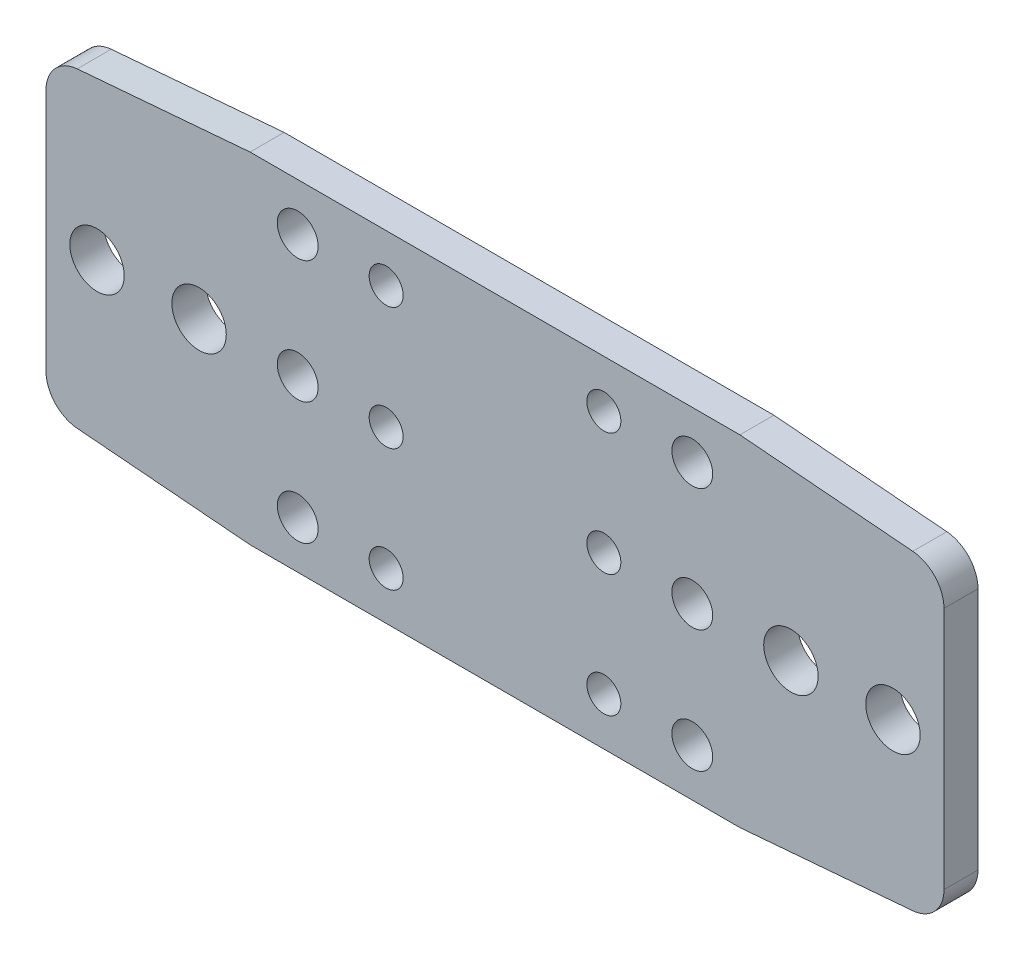
ISO-10303-21;
HEADER;
FILE_DESCRIPTION(('STEP AP214'),'2;1');
FILE_NAME('part.step','',(''),(''),'','','');
FILE_SCHEMA(('AUTOMOTIVE_DESIGN { 1 0 10303 214 1 1 1 1 }'));
ENDSEC;
DATA;
#1=APPLICATION_CONTEXT('core data for automotive mechanical design processes');
#2=APPLICATION_PROTOCOL_DEFINITION('international standard','automotive_design',2000,#1);
#3=PRODUCT_CONTEXT('',#1,'mechanical');
#4=PRODUCT('Part','Part','',(#3));
#5=PRODUCT_RELATED_PRODUCT_CATEGORY('part','',(#4));
#6=PRODUCT_DEFINITION_FORMATION('','',#4);
#7=PRODUCT_DEFINITION_CONTEXT('part definition',#1,'design');
#8=PRODUCT_DEFINITION('design','',#6,#7);
#9=PRODUCT_DEFINITION_SHAPE('','',#8);
#10=(LENGTH_UNIT() NAMED_UNIT(*) SI_UNIT(.MILLI.,.METRE.));
#11=(NAMED_UNIT(*) PLANE_ANGLE_UNIT() SI_UNIT($,.RADIAN.));
#12=(NAMED_UNIT(*) SI_UNIT($,.STERADIAN.) SOLID_ANGLE_UNIT());
#13=UNCERTAINTY_MEASURE_WITH_UNIT(LENGTH_MEASURE(1.E-05),#10,'distance_accuracy_value','');
#14=(GEOMETRIC_REPRESENTATION_CONTEXT(3) GLOBAL_UNCERTAINTY_ASSIGNED_CONTEXT((#13)) GLOBAL_UNIT_ASSIGNED_CONTEXT((#10,
#11,#12)) REPRESENTATION_CONTEXT('',''));
#15=CARTESIAN_POINT('',(0.,0.,0.));
#16=DIRECTION('',(0.,0.,1.));
#17=DIRECTION('',(1.,0.,0.));
#18=AXIS2_PLACEMENT_3D('',#15,#16,#17);
#19=CARTESIAN_POINT('',(0.,0.,5.));
#20=DIRECTION('',(0.,0.,-1.));
#21=DIRECTION('',(-1.,0.,0.));
#22=AXIS2_PLACEMENT_3D('',#19,#20,#21);
#23=PLANE('',#22);
#24=DIRECTION('',(0.,1.,0.));
#25=VECTOR('',#24,1.);
#26=CARTESIAN_POINT('',(102.,-47.5,5.));
#27=LINE('',#26,#25);
#28=CARTESIAN_POINT('',(102.,-42.8993355921699,5.));
#29=VERTEX_POINT('',#28);
#30=CARTESIAN_POINT('',(102.,-7.10066440783014,5.));
#31=VERTEX_POINT('',#30);
#32=EDGE_CURVE('E260',#29,#31,#27,.T.);
#33=ORIENTED_EDGE('',*,*,#32,.T.);
#34=CARTESIAN_POINT('',(97.,-7.10066440783012,5.));
#35=DIRECTION('',(0.,0.,-1.));
#36=DIRECTION('',(-1.,0.,0.));
#37=AXIS2_PLACEMENT_3D('',#34,#35,#36);
#38=CIRCLE('',#37,5.);
#39=CARTESIAN_POINT('',(97.4152273992687,-2.11793561660572,5.));
#40=VERTEX_POINT('',#39);
#41=EDGE_CURVE('E144',#31,#40,#38,.F.);
#42=ORIENTED_EDGE('',*,*,#41,.T.);
#43=DIRECTION('',(-0.99654575824488,0.0830454798537397,0.));
#44=VECTOR('',#43,1.);
#45=CARTESIAN_POINT('',(102.,-2.49999999999999,5.));
#46=LINE('',#45,#44);
#47=CARTESIAN_POINT('',(72.,0.,5.));
#48=VERTEX_POINT('',#47);
#49=EDGE_CURVE('E136',#40,#48,#46,.T.);
#50=ORIENTED_EDGE('',*,*,#49,.T.);
#51=DIRECTION('',(-1.,0.,0.));
#52=VECTOR('',#51,1.);
#53=CARTESIAN_POINT('',(72.,0.,5.));
#54=LINE('',#53,#52);
#55=CARTESIAN_POINT('',(0.,0.,5.));
#56=VERTEX_POINT('',#55);
#57=EDGE_CURVE('E141',#48,#56,#54,.T.);
#58=ORIENTED_EDGE('',*,*,#57,.T.);
#59=DIRECTION('',(-0.996545758244879,-0.0830454798537403,0.));
#60=VECTOR('',#59,1.);
#61=CARTESIAN_POINT('',(-30.,-2.50000000000001,5.));
#62=LINE('',#61,#60);
#63=CARTESIAN_POINT('',(-25.4152273992687,-2.11793561660573,5.));
#64=VERTEX_POINT('',#63);
#65=EDGE_CURVE('E160',#56,#64,#62,.T.);
#66=ORIENTED_EDGE('',*,*,#65,.T.);
#67=CARTESIAN_POINT('',(-25.,-7.10066440783014,5.));
#68=DIRECTION('',(0.,0.,-1.));
#69=DIRECTION('',(-1.,0.,0.));
#70=AXIS2_PLACEMENT_3D('',#67,#68,#69);
#71=CIRCLE('',#70,5.);
#72=CARTESIAN_POINT('',(-30.,-7.10066440783015,5.));
#73=VERTEX_POINT('',#72);
#74=EDGE_CURVE('E197',#64,#73,#71,.F.);
#75=ORIENTED_EDGE('',*,*,#74,.T.);
#76=DIRECTION('',(0.,-1.,0.));
#77=VECTOR('',#76,1.);
#78=CARTESIAN_POINT('',(-30.,-47.5,5.));
#79=LINE('',#78,#77);
#80=CARTESIAN_POINT('',(-30.,-42.8993355921699,5.));
#81=VERTEX_POINT('',#80);
#82=EDGE_CURVE('E224',#73,#81,#79,.T.);
#83=ORIENTED_EDGE('',*,*,#82,.T.);
#84=CARTESIAN_POINT('',(-25.,-42.8993355921699,5.));
#85=DIRECTION('',(0.,0.,-1.));
#86=DIRECTION('',(-1.,0.,0.));
#87=AXIS2_PLACEMENT_3D('',#84,#85,#86);
#88=CIRCLE('',#87,5.);
#89=CARTESIAN_POINT('',(-25.4152273992687,-47.8820643833943,5.));
#90=VERTEX_POINT('',#89);
#91=EDGE_CURVE('E69',#81,#90,#88,.F.);
#92=ORIENTED_EDGE('',*,*,#91,.T.);
#93=DIRECTION('',(0.99654575824488,-0.0830454798537401,0.));
#94=VECTOR('',#93,1.);
#95=CARTESIAN_POINT('',(-30.,-47.5,5.));
#96=LINE('',#95,#94);
#97=CARTESIAN_POINT('',(0.,-50.,5.));
#98=VERTEX_POINT('',#97);
#99=EDGE_CURVE('E557',#90,#98,#96,.T.);
#100=ORIENTED_EDGE('',*,*,#99,.T.);
#101=DIRECTION('',(1.,0.,0.));
#102=VECTOR('',#101,1.);
#103=CARTESIAN_POINT('',(0.,-50.,5.));
#104=LINE('',#103,#102);
#105=CARTESIAN_POINT('',(72.,-50.,5.));
#106=VERTEX_POINT('',#105);
#107=EDGE_CURVE('E269',#98,#106,#104,.T.);
#108=ORIENTED_EDGE('',*,*,#107,.T.);
#109=DIRECTION('',(0.99654575824488,0.0830454798537405,0.));
#110=VECTOR('',#109,1.);
#111=CARTESIAN_POINT('',(102.,-47.5,5.));
#112=LINE('',#111,#110);
#113=CARTESIAN_POINT('',(97.4152273992687,-47.8820643833943,5.));
#114=VERTEX_POINT('',#113);
#115=EDGE_CURVE('E279',#106,#114,#112,.T.);
#116=ORIENTED_EDGE('',*,*,#115,.T.);
#117=CARTESIAN_POINT('',(97.,-42.8993355921699,5.));
#118=DIRECTION('',(0.,0.,-1.));
#119=DIRECTION('',(-1.,0.,0.));
#120=AXIS2_PLACEMENT_3D('',#117,#118,#119);
#121=CIRCLE('',#120,5.);
#122=EDGE_CURVE('E200',#114,#29,#121,.F.);
#123=ORIENTED_EDGE('',*,*,#122,.T.);
#124=EDGE_LOOP('',(#33,#42,#50,#58,#66,#75,#83,#92,#100,#108,#116,#123));
#125=FACE_BOUND('',#124,.T.);
#126=CARTESIAN_POINT('',(7.,-43.,5.));
#127=DIRECTION('',(0.,0.,1.));
#128=DIRECTION('',(1.,0.,0.));
#129=AXIS2_PLACEMENT_3D('',#126,#127,#128);
#130=CIRCLE('',#129,3.);
#131=CARTESIAN_POINT('',(10.,-43.,5.));
#132=VERTEX_POINT('',#131);
#133=EDGE_CURVE('E290',#132,#132,#130,.T.);
#134=ORIENTED_EDGE('',*,*,#133,.F.);
#135=EDGE_LOOP('',(#134));
#136=FACE_BOUND('',#135,.T.);
#137=CARTESIAN_POINT('',(7.,-25.,5.));
#138=DIRECTION('',(0.,0.,1.));
#139=DIRECTION('',(1.,0.,0.));
#140=AXIS2_PLACEMENT_3D('',#137,#138,#139);
#141=CIRCLE('',#140,3.);
#142=CARTESIAN_POINT('',(10.,-25.,5.));
#143=VERTEX_POINT('',#142);
#144=EDGE_CURVE('E568',#143,#143,#141,.T.);
#145=ORIENTED_EDGE('',*,*,#144,.F.);
#146=EDGE_LOOP('',(#145));
#147=FACE_BOUND('',#146,.T.);
#148=CARTESIAN_POINT('',(65.,-43.,5.));
#149=DIRECTION('',(0.,0.,1.));
#150=DIRECTION('',(1.,0.,0.));
#151=AXIS2_PLACEMENT_3D('',#148,#149,#150);
#152=CIRCLE('',#151,3.);
#153=CARTESIAN_POINT('',(68.,-43.,5.));
#154=VERTEX_POINT('',#153);
#155=EDGE_CURVE('E576',#154,#154,#152,.T.);
#156=ORIENTED_EDGE('',*,*,#155,.F.);
#157=EDGE_LOOP('',(#156));
#158=FACE_BOUND('',#157,.T.);
#159=CARTESIAN_POINT('',(65.,-7.,5.));
#160=DIRECTION('',(0.,0.,1.));
#161=DIRECTION('',(1.,0.,0.));
#162=AXIS2_PLACEMENT_3D('',#159,#160,#161);
#163=CIRCLE('',#162,3.);
#164=CARTESIAN_POINT('',(68.,-7.,5.));
#165=VERTEX_POINT('',#164);
#166=EDGE_CURVE('E584',#165,#165,#163,.T.);
#167=ORIENTED_EDGE('',*,*,#166,.F.);
#168=EDGE_LOOP('',(#167));
#169=FACE_BOUND('',#168,.T.);
#170=CARTESIAN_POINT('',(65.,-25.,5.));
#171=DIRECTION('',(0.,0.,1.));
#172=DIRECTION('',(1.,0.,0.));
#173=AXIS2_PLACEMENT_3D('',#170,#171,#172);
#174=CIRCLE('',#173,3.00000000000001);
#175=CARTESIAN_POINT('',(68.,-25.,5.));
#176=VERTEX_POINT('',#175);
#177=EDGE_CURVE('E592',#176,#176,#174,.T.);
#178=ORIENTED_EDGE('',*,*,#177,.F.);
#179=EDGE_LOOP('',(#178));
#180=FACE_BOUND('',#179,.T.);
#181=CARTESIAN_POINT('',(7.,-7.,5.));
#182=DIRECTION('',(0.,0.,1.));
#183=DIRECTION('',(1.,0.,0.));
#184=AXIS2_PLACEMENT_3D('',#181,#182,#183);
#185=CIRCLE('',#184,3.);
#186=CARTESIAN_POINT('',(10.,-7.,5.));
#187=VERTEX_POINT('',#186);
#188=EDGE_CURVE('E600',#187,#187,#185,.T.);
#189=ORIENTED_EDGE('',*,*,#188,.F.);
#190=EDGE_LOOP('',(#189));
#191=FACE_BOUND('',#190,.T.);
#192=CARTESIAN_POINT('',(20.,-7.,5.));
#193=DIRECTION('',(0.,0.,1.));
#194=DIRECTION('',(1.,0.,0.));
#195=AXIS2_PLACEMENT_3D('',#192,#193,#194);
#196=CIRCLE('',#195,2.5);
#197=CARTESIAN_POINT('',(22.5,-7.,5.));
#198=VERTEX_POINT('',#197);
#199=EDGE_CURVE('E608',#198,#198,#196,.T.);
#200=ORIENTED_EDGE('',*,*,#199,.F.);
#201=EDGE_LOOP('',(#200));
#202=FACE_BOUND('',#201,.T.);
#203=CARTESIAN_POINT('',(20.,-43.,5.));
#204=DIRECTION('',(0.,0.,1.));
#205=DIRECTION('',(1.,0.,0.));
#206=AXIS2_PLACEMENT_3D('',#203,#204,#205);
#207=CIRCLE('',#206,2.5);
#208=CARTESIAN_POINT('',(22.5,-43.,5.));
#209=VERTEX_POINT('',#208);
#210=EDGE_CURVE('E616',#209,#209,#207,.T.);
#211=ORIENTED_EDGE('',*,*,#210,.F.);
#212=EDGE_LOOP('',(#211));
#213=FACE_BOUND('',#212,.T.);
#214=CARTESIAN_POINT('',(-22.5,-25.,5.));
#215=DIRECTION('',(0.,0.,1.));
#216=DIRECTION('',(1.,0.,0.));
#217=AXIS2_PLACEMENT_3D('',#214,#215,#216);
#218=CIRCLE('',#217,4.);
#219=CARTESIAN_POINT('',(-18.5,-25.,5.));
#220=VERTEX_POINT('',#219);
#221=EDGE_CURVE('E624',#220,#220,#218,.T.);
#222=ORIENTED_EDGE('',*,*,#221,.F.);
#223=EDGE_LOOP('',(#222));
#224=FACE_BOUND('',#223,.T.);
#225=CARTESIAN_POINT('',(-7.5,-25.,5.));
#226=DIRECTION('',(0.,0.,1.));
#227=DIRECTION('',(1.,0.,0.));
#228=AXIS2_PLACEMENT_3D('',#225,#226,#227);
#229=CIRCLE('',#228,4.);
#230=CARTESIAN_POINT('',(-3.5,-25.,5.));
#231=VERTEX_POINT('',#230);
#232=EDGE_CURVE('E632',#231,#231,#229,.T.);
#233=ORIENTED_EDGE('',*,*,#232,.F.);
#234=EDGE_LOOP('',(#233));
#235=FACE_BOUND('',#234,.T.);
#236=CARTESIAN_POINT('',(52.,-43.,5.));
#237=DIRECTION('',(0.,0.,1.));
#238=DIRECTION('',(-1.,0.,0.));
#239=AXIS2_PLACEMENT_3D('',#236,#237,#238);
#240=CIRCLE('',#239,2.5);
#241=CARTESIAN_POINT('',(49.5,-43.,5.));
#242=VERTEX_POINT('',#241);
#243=EDGE_CURVE('E640',#242,#242,#240,.T.);
#244=ORIENTED_EDGE('',*,*,#243,.F.);
#245=EDGE_LOOP('',(#244));
#246=FACE_BOUND('',#245,.T.);
#247=CARTESIAN_POINT('',(52.,-7.,5.));
#248=DIRECTION('',(0.,0.,1.));
#249=DIRECTION('',(-1.,0.,0.));
#250=AXIS2_PLACEMENT_3D('',#247,#248,#249);
#251=CIRCLE('',#250,2.49999999999999);
#252=CARTESIAN_POINT('',(49.5,-7.,5.));
#253=VERTEX_POINT('',#252);
#254=EDGE_CURVE('E648',#253,#253,#251,.T.);
#255=ORIENTED_EDGE('',*,*,#254,.F.);
#256=EDGE_LOOP('',(#255));
#257=FACE_BOUND('',#256,.T.);
#258=CARTESIAN_POINT('',(79.5,-25.,5.));
#259=DIRECTION('',(0.,0.,1.));
#260=DIRECTION('',(-1.,0.,0.));
#261=AXIS2_PLACEMENT_3D('',#258,#259,#260);
#262=CIRCLE('',#261,4.00000000000002);
#263=CARTESIAN_POINT('',(75.5,-25.,5.));
#264=VERTEX_POINT('',#263);
#265=EDGE_CURVE('E656',#264,#264,#262,.T.);
#266=ORIENTED_EDGE('',*,*,#265,.F.);
#267=EDGE_LOOP('',(#266));
#268=FACE_BOUND('',#267,.T.);
#269=CARTESIAN_POINT('',(94.5,-25.,5.));
#270=DIRECTION('',(0.,0.,1.));
#271=DIRECTION('',(-1.,0.,0.));
#272=AXIS2_PLACEMENT_3D('',#269,#270,#271);
#273=CIRCLE('',#272,4.00000000000001);
#274=CARTESIAN_POINT('',(90.5,-25.,5.));
#275=VERTEX_POINT('',#274);
#276=EDGE_CURVE('E664',#275,#275,#273,.T.);
#277=ORIENTED_EDGE('',*,*,#276,.F.);
#278=EDGE_LOOP('',(#277));
#279=FACE_BOUND('',#278,.T.);
#280=CARTESIAN_POINT('',(20.,-25.,5.));
#281=DIRECTION('',(0.,0.,1.));
#282=DIRECTION('',(1.,0.,0.));
#283=AXIS2_PLACEMENT_3D('',#280,#281,#282);
#284=CIRCLE('',#283,2.5);
#285=CARTESIAN_POINT('',(22.5,-25.,5.));
#286=VERTEX_POINT('',#285);
#287=EDGE_CURVE('E672',#286,#286,#284,.T.);
#288=ORIENTED_EDGE('',*,*,#287,.F.);
#289=EDGE_LOOP('',(#288));
#290=FACE_BOUND('',#289,.T.);
#291=CARTESIAN_POINT('',(52.,-25.,5.));
#292=DIRECTION('',(0.,0.,1.));
#293=DIRECTION('',(1.,0.,0.));
#294=AXIS2_PLACEMENT_3D('',#291,#292,#293);
#295=CIRCLE('',#294,2.5);
#296=CARTESIAN_POINT('',(54.5,-25.,5.));
#297=VERTEX_POINT('',#296);
#298=EDGE_CURVE('E680',#297,#297,#295,.T.);
#299=ORIENTED_EDGE('',*,*,#298,.F.);
#300=EDGE_LOOP('',(#299));
#301=FACE_BOUND('',#300,.T.);
#302=ADVANCED_FACE('F45',(#125,#136,#147,#158,#169,#180,#191,#202,#213,#224,#235,#246,#257,#268,
#279,#290,#301),#23,.F.);
#303=CARTESIAN_POINT('',(0.,0.,0.));
#304=DIRECTION('',(0.,0.,-1.));
#305=DIRECTION('',(-1.,0.,0.));
#306=AXIS2_PLACEMENT_3D('',#303,#304,#305);
#307=PLANE('',#306);
#308=CARTESIAN_POINT('',(20.,-25.,0.));
#309=DIRECTION('',(0.,0.,1.));
#310=DIRECTION('',(1.,0.,0.));
#311=AXIS2_PLACEMENT_3D('',#308,#309,#310);
#312=CIRCLE('',#311,2.5);
#313=CARTESIAN_POINT('',(22.5,-25.,0.));
#314=VERTEX_POINT('',#313);
#315=EDGE_CURVE('E676',#314,#314,#312,.T.);
#316=ORIENTED_EDGE('',*,*,#315,.T.);
#317=EDGE_LOOP('',(#316));
#318=FACE_BOUND('',#317,.T.);
#319=CARTESIAN_POINT('',(79.5,-25.,0.));
#320=DIRECTION('',(0.,0.,1.));
#321=DIRECTION('',(-1.,0.,0.));
#322=AXIS2_PLACEMENT_3D('',#319,#320,#321);
#323=CIRCLE('',#322,4.00000000000002);
#324=CARTESIAN_POINT('',(75.5,-25.,0.));
#325=VERTEX_POINT('',#324);
#326=EDGE_CURVE('E660',#325,#325,#323,.T.);
#327=ORIENTED_EDGE('',*,*,#326,.T.);
#328=EDGE_LOOP('',(#327));
#329=FACE_BOUND('',#328,.T.);
#330=CARTESIAN_POINT('',(52.,-43.,0.));
#331=DIRECTION('',(0.,0.,1.));
#332=DIRECTION('',(-1.,0.,0.));
#333=AXIS2_PLACEMENT_3D('',#330,#331,#332);
#334=CIRCLE('',#333,2.5);
#335=CARTESIAN_POINT('',(49.5,-43.,0.));
#336=VERTEX_POINT('',#335);
#337=EDGE_CURVE('E644',#336,#336,#334,.T.);
#338=ORIENTED_EDGE('',*,*,#337,.T.);
#339=EDGE_LOOP('',(#338));
#340=FACE_BOUND('',#339,.T.);
#341=CARTESIAN_POINT('',(-22.5,-25.,0.));
#342=DIRECTION('',(0.,0.,1.));
#343=DIRECTION('',(1.,0.,0.));
#344=AXIS2_PLACEMENT_3D('',#341,#342,#343);
#345=CIRCLE('',#344,4.);
#346=CARTESIAN_POINT('',(-18.5,-25.,0.));
#347=VERTEX_POINT('',#346);
#348=EDGE_CURVE('E628',#347,#347,#345,.T.);
#349=ORIENTED_EDGE('',*,*,#348,.T.);
#350=EDGE_LOOP('',(#349));
#351=FACE_BOUND('',#350,.T.);
#352=CARTESIAN_POINT('',(20.,-7.,0.));
#353=DIRECTION('',(0.,0.,1.));
#354=DIRECTION('',(1.,0.,0.));
#355=AXIS2_PLACEMENT_3D('',#352,#353,#354);
#356=CIRCLE('',#355,2.5);
#357=CARTESIAN_POINT('',(22.5,-7.,0.));
#358=VERTEX_POINT('',#357);
#359=EDGE_CURVE('E612',#358,#358,#356,.T.);
#360=ORIENTED_EDGE('',*,*,#359,.T.);
#361=EDGE_LOOP('',(#360));
#362=FACE_BOUND('',#361,.T.);
#363=CARTESIAN_POINT('',(65.,-25.,0.));
#364=DIRECTION('',(0.,0.,1.));
#365=DIRECTION('',(1.,0.,0.));
#366=AXIS2_PLACEMENT_3D('',#363,#364,#365);
#367=CIRCLE('',#366,3.00000000000001);
#368=CARTESIAN_POINT('',(68.,-25.,0.));
#369=VERTEX_POINT('',#368);
#370=EDGE_CURVE('E596',#369,#369,#367,.T.);
#371=ORIENTED_EDGE('',*,*,#370,.T.);
#372=EDGE_LOOP('',(#371));
#373=FACE_BOUND('',#372,.T.);
#374=CARTESIAN_POINT('',(65.,-43.,0.));
#375=DIRECTION('',(0.,0.,1.));
#376=DIRECTION('',(1.,0.,0.));
#377=AXIS2_PLACEMENT_3D('',#374,#375,#376);
#378=CIRCLE('',#377,3.);
#379=CARTESIAN_POINT('',(68.,-43.,0.));
#380=VERTEX_POINT('',#379);
#381=EDGE_CURVE('E580',#380,#380,#378,.T.);
#382=ORIENTED_EDGE('',*,*,#381,.T.);
#383=EDGE_LOOP('',(#382));
#384=FACE_BOUND('',#383,.T.);
#385=CARTESIAN_POINT('',(7.,-43.,0.));
#386=DIRECTION('',(0.,0.,1.));
#387=DIRECTION('',(1.,0.,0.));
#388=AXIS2_PLACEMENT_3D('',#385,#386,#387);
#389=CIRCLE('',#388,3.);
#390=CARTESIAN_POINT('',(10.,-43.,0.));
#391=VERTEX_POINT('',#390);
#392=EDGE_CURVE('E564',#391,#391,#389,.T.);
#393=ORIENTED_EDGE('',*,*,#392,.T.);
#394=EDGE_LOOP('',(#393));
#395=FACE_BOUND('',#394,.T.);
#396=DIRECTION('',(-0.99654575824488,0.0830454798537397,0.));
#397=VECTOR('',#396,1.);
#398=CARTESIAN_POINT('',(102.,-2.49999999999999,0.));
#399=LINE('',#398,#397);
#400=CARTESIAN_POINT('',(97.4152273992687,-2.11793561660572,0.));
#401=VERTEX_POINT('',#400);
#402=CARTESIAN_POINT('',(72.,0.,0.));
#403=VERTEX_POINT('',#402);
#404=EDGE_CURVE('E164',#401,#403,#399,.T.);
#405=ORIENTED_EDGE('',*,*,#404,.F.);
#406=CARTESIAN_POINT('',(97.,-7.10066440783012,0.));
#407=DIRECTION('',(0.,0.,-1.));
#408=DIRECTION('',(-1.,0.,0.));
#409=AXIS2_PLACEMENT_3D('',#406,#407,#408);
#410=CIRCLE('',#409,5.);
#411=CARTESIAN_POINT('',(102.,-7.10066440783014,0.));
#412=VERTEX_POINT('',#411);
#413=EDGE_CURVE('E185',#401,#412,#410,.T.);
#414=ORIENTED_EDGE('',*,*,#413,.T.);
#415=DIRECTION('',(0.,1.,0.));
#416=VECTOR('',#415,1.);
#417=CARTESIAN_POINT('',(102.,-47.5,0.));
#418=LINE('',#417,#416);
#419=CARTESIAN_POINT('',(102.,-42.8993355921699,0.));
#420=VERTEX_POINT('',#419);
#421=EDGE_CURVE('E150',#420,#412,#418,.T.);
#422=ORIENTED_EDGE('',*,*,#421,.F.);
#423=CARTESIAN_POINT('',(97.,-42.8993355921699,0.));
#424=DIRECTION('',(0.,0.,-1.));
#425=DIRECTION('',(-1.,0.,0.));
#426=AXIS2_PLACEMENT_3D('',#423,#424,#425);
#427=CIRCLE('',#426,5.);
#428=CARTESIAN_POINT('',(97.4152273992687,-47.8820643833943,0.));
#429=VERTEX_POINT('',#428);
#430=EDGE_CURVE('E182',#420,#429,#427,.T.);
#431=ORIENTED_EDGE('',*,*,#430,.T.);
#432=DIRECTION('',(0.99654575824488,0.0830454798537405,0.));
#433=VECTOR('',#432,1.);
#434=CARTESIAN_POINT('',(102.,-47.5,0.));
#435=LINE('',#434,#433);
#436=CARTESIAN_POINT('',(72.,-50.,0.));
#437=VERTEX_POINT('',#436);
#438=EDGE_CURVE('E251',#437,#429,#435,.T.);
#439=ORIENTED_EDGE('',*,*,#438,.F.);
#440=DIRECTION('',(1.,0.,0.));
#441=VECTOR('',#440,1.);
#442=CARTESIAN_POINT('',(0.,-50.,0.));
#443=LINE('',#442,#441);
#444=CARTESIAN_POINT('',(0.,-50.,0.));
#445=VERTEX_POINT('',#444);
#446=EDGE_CURVE('E243',#445,#437,#443,.T.);
#447=ORIENTED_EDGE('',*,*,#446,.F.);
#448=DIRECTION('',(0.99654575824488,-0.0830454798537401,0.));
#449=VECTOR('',#448,1.);
#450=CARTESIAN_POINT('',(-30.,-47.5,0.));
#451=LINE('',#450,#449);
#452=CARTESIAN_POINT('',(-25.4152273992687,-47.8820643833943,0.));
#453=VERTEX_POINT('',#452);
#454=EDGE_CURVE('E239',#453,#445,#451,.T.);
#455=ORIENTED_EDGE('',*,*,#454,.F.);
#456=CARTESIAN_POINT('',(-25.,-42.8993355921699,0.));
#457=DIRECTION('',(0.,0.,-1.));
#458=DIRECTION('',(-1.,0.,0.));
#459=AXIS2_PLACEMENT_3D('',#456,#457,#458);
#460=CIRCLE('',#459,5.);
#461=CARTESIAN_POINT('',(-30.,-42.8993355921699,0.));
#462=VERTEX_POINT('',#461);
#463=EDGE_CURVE('E171',#453,#462,#460,.T.);
#464=ORIENTED_EDGE('',*,*,#463,.T.);
#465=DIRECTION('',(0.,-1.,0.));
#466=VECTOR('',#465,1.);
#467=CARTESIAN_POINT('',(-30.,-47.5,0.));
#468=LINE('',#467,#466);
#469=CARTESIAN_POINT('',(-30.,-7.10066440783015,0.));
#470=VERTEX_POINT('',#469);
#471=EDGE_CURVE('E232',#470,#462,#468,.T.);
#472=ORIENTED_EDGE('',*,*,#471,.F.);
#473=CARTESIAN_POINT('',(-25.,-7.10066440783014,0.));
#474=DIRECTION('',(0.,0.,-1.));
#475=DIRECTION('',(-1.,0.,0.));
#476=AXIS2_PLACEMENT_3D('',#473,#474,#475);
#477=CIRCLE('',#476,5.);
#478=CARTESIAN_POINT('',(-25.4152273992687,-2.11793561660573,0.));
#479=VERTEX_POINT('',#478);
#480=EDGE_CURVE('E179',#470,#479,#477,.T.);
#481=ORIENTED_EDGE('',*,*,#480,.T.);
#482=DIRECTION('',(-0.996545758244879,-0.0830454798537403,0.));
#483=VECTOR('',#482,1.);
#484=CARTESIAN_POINT('',(-30.,-2.50000000000001,0.));
#485=LINE('',#484,#483);
#486=CARTESIAN_POINT('',(0.,0.,0.));
#487=VERTEX_POINT('',#486);
#488=EDGE_CURVE('E219',#487,#479,#485,.T.);
#489=ORIENTED_EDGE('',*,*,#488,.F.);
#490=DIRECTION('',(-1.,0.,0.));
#491=VECTOR('',#490,1.);
#492=CARTESIAN_POINT('',(72.,0.,0.));
#493=LINE('',#492,#491);
#494=EDGE_CURVE('E245',#403,#487,#493,.T.);
#495=ORIENTED_EDGE('',*,*,#494,.F.);
#496=EDGE_LOOP('',(#405,#414,#422,#431,#439,#447,#455,#464,#472,#481,#489,#495));
#497=FACE_BOUND('',#496,.T.);
#498=CARTESIAN_POINT('',(7.,-25.,0.));
#499=DIRECTION('',(0.,0.,1.));
#500=DIRECTION('',(1.,0.,0.));
#501=AXIS2_PLACEMENT_3D('',#498,#499,#500);
#502=CIRCLE('',#501,3.);
#503=CARTESIAN_POINT('',(10.,-25.,0.));
#504=VERTEX_POINT('',#503);
#505=EDGE_CURVE('E572',#504,#504,#502,.T.);
#506=ORIENTED_EDGE('',*,*,#505,.T.);
#507=EDGE_LOOP('',(#506));
#508=FACE_BOUND('',#507,.T.);
#509=CARTESIAN_POINT('',(65.,-7.,0.));
#510=DIRECTION('',(0.,0.,1.));
#511=DIRECTION('',(1.,0.,0.));
#512=AXIS2_PLACEMENT_3D('',#509,#510,#511);
#513=CIRCLE('',#512,3.);
#514=CARTESIAN_POINT('',(68.,-7.,0.));
#515=VERTEX_POINT('',#514);
#516=EDGE_CURVE('E588',#515,#515,#513,.T.);
#517=ORIENTED_EDGE('',*,*,#516,.T.);
#518=EDGE_LOOP('',(#517));
#519=FACE_BOUND('',#518,.T.);
#520=CARTESIAN_POINT('',(7.,-7.,0.));
#521=DIRECTION('',(0.,0.,1.));
#522=DIRECTION('',(1.,0.,0.));
#523=AXIS2_PLACEMENT_3D('',#520,#521,#522);
#524=CIRCLE('',#523,3.);
#525=CARTESIAN_POINT('',(10.,-7.,0.));
#526=VERTEX_POINT('',#525);
#527=EDGE_CURVE('E604',#526,#526,#524,.T.);
#528=ORIENTED_EDGE('',*,*,#527,.T.);
#529=EDGE_LOOP('',(#528));
#530=FACE_BOUND('',#529,.T.);
#531=CARTESIAN_POINT('',(20.,-43.,0.));
#532=DIRECTION('',(0.,0.,1.));
#533=DIRECTION('',(1.,0.,0.));
#534=AXIS2_PLACEMENT_3D('',#531,#532,#533);
#535=CIRCLE('',#534,2.5);
#536=CARTESIAN_POINT('',(22.5,-43.,0.));
#537=VERTEX_POINT('',#536);
#538=EDGE_CURVE('E620',#537,#537,#535,.T.);
#539=ORIENTED_EDGE('',*,*,#538,.T.);
#540=EDGE_LOOP('',(#539));
#541=FACE_BOUND('',#540,.T.);
#542=CARTESIAN_POINT('',(-7.5,-25.,0.));
#543=DIRECTION('',(0.,0.,1.));
#544=DIRECTION('',(1.,0.,0.));
#545=AXIS2_PLACEMENT_3D('',#542,#543,#544);
#546=CIRCLE('',#545,4.);
#547=CARTESIAN_POINT('',(-3.5,-25.,0.));
#548=VERTEX_POINT('',#547);
#549=EDGE_CURVE('E636',#548,#548,#546,.T.);
#550=ORIENTED_EDGE('',*,*,#549,.T.);
#551=EDGE_LOOP('',(#550));
#552=FACE_BOUND('',#551,.T.);
#553=CARTESIAN_POINT('',(52.,-7.,0.));
#554=DIRECTION('',(0.,0.,1.));
#555=DIRECTION('',(-1.,0.,0.));
#556=AXIS2_PLACEMENT_3D('',#553,#554,#555);
#557=CIRCLE('',#556,2.49999999999999);
#558=CARTESIAN_POINT('',(49.5,-7.,0.));
#559=VERTEX_POINT('',#558);
#560=EDGE_CURVE('E652',#559,#559,#557,.T.);
#561=ORIENTED_EDGE('',*,*,#560,.T.);
#562=EDGE_LOOP('',(#561));
#563=FACE_BOUND('',#562,.T.);
#564=CARTESIAN_POINT('',(94.5,-25.,0.));
#565=DIRECTION('',(0.,0.,1.));
#566=DIRECTION('',(-1.,0.,0.));
#567=AXIS2_PLACEMENT_3D('',#564,#565,#566);
#568=CIRCLE('',#567,4.00000000000001);
#569=CARTESIAN_POINT('',(90.5,-25.,0.));
#570=VERTEX_POINT('',#569);
#571=EDGE_CURVE('E668',#570,#570,#568,.T.);
#572=ORIENTED_EDGE('',*,*,#571,.T.);
#573=EDGE_LOOP('',(#572));
#574=FACE_BOUND('',#573,.T.);
#575=CARTESIAN_POINT('',(52.,-25.,0.));
#576=DIRECTION('',(0.,0.,1.));
#577=DIRECTION('',(1.,0.,0.));
#578=AXIS2_PLACEMENT_3D('',#575,#576,#577);
#579=CIRCLE('',#578,2.5);
#580=CARTESIAN_POINT('',(54.5,-25.,0.));
#581=VERTEX_POINT('',#580);
#582=EDGE_CURVE('E684',#581,#581,#579,.T.);
#583=ORIENTED_EDGE('',*,*,#582,.T.);
#584=EDGE_LOOP('',(#583));
#585=FACE_BOUND('',#584,.T.);
#586=ADVANCED_FACE('F235',(#318,#329,#340,#351,#362,#373,#384,#395,#497,#508,#519,#530,#541,
#552,#563,#574,#585),#307,.T.);
#587=CARTESIAN_POINT('',(102.,-2.49999999999999,5.));
#588=DIRECTION('',(-0.0830454798537397,-0.99654575824488,0.));
#589=DIRECTION('',(0.99654575824488,-0.0830454798537397,0.));
#590=AXIS2_PLACEMENT_3D('',#587,#588,#589);
#591=PLANE('',#590);
#592=ORIENTED_EDGE('',*,*,#49,.F.);
#593=DIRECTION('',(0.,0.,-1.));
#594=VECTOR('',#593,1.);
#595=CARTESIAN_POINT('',(97.4152273992687,-2.11793561660572,5.));
#596=LINE('',#595,#594);
#597=EDGE_CURVE('E167',#40,#401,#596,.T.);
#598=ORIENTED_EDGE('',*,*,#597,.T.);
#599=ORIENTED_EDGE('',*,*,#404,.T.);
#600=DIRECTION('',(0.,0.,-1.));
#601=VECTOR('',#600,1.);
#602=CARTESIAN_POINT('',(72.,0.,5.));
#603=LINE('',#602,#601);
#604=EDGE_CURVE('E155',#48,#403,#603,.T.);
#605=ORIENTED_EDGE('',*,*,#604,.F.);
#606=EDGE_LOOP('',(#592,#598,#599,#605));
#607=FACE_BOUND('',#606,.T.);
#608=ADVANCED_FACE('F162',(#607),#591,.F.);
#609=CARTESIAN_POINT('',(72.,0.,5.));
#610=DIRECTION('',(0.,-1.,0.));
#611=DIRECTION('',(0.,0.,-1.));
#612=AXIS2_PLACEMENT_3D('',#609,#610,#611);
#613=PLANE('',#612);
#614=ORIENTED_EDGE('',*,*,#494,.T.);
#615=DIRECTION('',(0.,0.,-1.));
#616=VECTOR('',#615,1.);
#617=CARTESIAN_POINT('',(0.,0.,5.));
#618=LINE('',#617,#616);
#619=EDGE_CURVE('E157',#56,#487,#618,.T.);
#620=ORIENTED_EDGE('',*,*,#619,.F.);
#621=ORIENTED_EDGE('',*,*,#57,.F.);
#622=ORIENTED_EDGE('',*,*,#604,.T.);
#623=EDGE_LOOP('',(#614,#620,#621,#622));
#624=FACE_BOUND('',#623,.T.);
#625=ADVANCED_FACE('F154',(#624),#613,.F.);
#626=CARTESIAN_POINT('',(-30.,-2.50000000000001,5.));
#627=DIRECTION('',(0.0830454798537403,-0.99654575824488,0.));
#628=DIRECTION('',(0.99654575824488,0.0830454798537403,0.));
#629=AXIS2_PLACEMENT_3D('',#626,#627,#628);
#630=PLANE('',#629);
#631=ORIENTED_EDGE('',*,*,#488,.T.);
#632=DIRECTION('',(0.,0.,-1.));
#633=VECTOR('',#632,1.);
#634=CARTESIAN_POINT('',(-25.4152273992687,-2.11793561660573,5.));
#635=LINE('',#634,#633);
#636=EDGE_CURVE('E54',#479,#64,#635,.F.);
#637=ORIENTED_EDGE('',*,*,#636,.T.);
#638=ORIENTED_EDGE('',*,*,#65,.F.);
#639=ORIENTED_EDGE('',*,*,#619,.T.);
#640=EDGE_LOOP('',(#631,#637,#638,#639));
#641=FACE_BOUND('',#640,.T.);
#642=ADVANCED_FACE('F217',(#641),#630,.F.);
#643=CARTESIAN_POINT('',(-30.,-47.5,5.));
#644=DIRECTION('',(1.,0.,0.));
#645=DIRECTION('',(0.,1.,0.));
#646=AXIS2_PLACEMENT_3D('',#643,#644,#645);
#647=PLANE('',#646);
#648=ORIENTED_EDGE('',*,*,#82,.F.);
#649=DIRECTION('',(0.,0.,-1.));
#650=VECTOR('',#649,1.);
#651=CARTESIAN_POINT('',(-30.,-7.10066440783014,5.));
#652=LINE('',#651,#650);
#653=EDGE_CURVE('E210',#73,#470,#652,.T.);
#654=ORIENTED_EDGE('',*,*,#653,.T.);
#655=ORIENTED_EDGE('',*,*,#471,.T.);
#656=DIRECTION('',(0.,0.,-1.));
#657=VECTOR('',#656,1.);
#658=CARTESIAN_POINT('',(-30.,-42.8993355921699,5.));
#659=LINE('',#658,#657);
#660=EDGE_CURVE('E207',#462,#81,#659,.F.);
#661=ORIENTED_EDGE('',*,*,#660,.T.);
#662=EDGE_LOOP('',(#648,#654,#655,#661));
#663=FACE_BOUND('',#662,.T.);
#664=ADVANCED_FACE('F231',(#663),#647,.F.);
#665=CARTESIAN_POINT('',(-30.,-47.5,5.));
#666=DIRECTION('',(0.0830454798537401,0.99654575824488,0.));
#667=DIRECTION('',(-0.99654575824488,0.0830454798537401,0.));
#668=AXIS2_PLACEMENT_3D('',#665,#666,#667);
#669=PLANE('',#668);
#670=ORIENTED_EDGE('',*,*,#99,.F.);
#671=DIRECTION('',(0.,0.,-1.));
#672=VECTOR('',#671,1.);
#673=CARTESIAN_POINT('',(-25.4152273992687,-47.8820643833943,5.));
#674=LINE('',#673,#672);
#675=EDGE_CURVE('E11',#90,#453,#674,.T.);
#676=ORIENTED_EDGE('',*,*,#675,.T.);
#677=ORIENTED_EDGE('',*,*,#454,.T.);
#678=DIRECTION('',(0.,0.,-1.));
#679=VECTOR('',#678,1.);
#680=CARTESIAN_POINT('',(0.,-50.,5.));
#681=LINE('',#680,#679);
#682=EDGE_CURVE('E173',#98,#445,#681,.T.);
#683=ORIENTED_EDGE('',*,*,#682,.F.);
#684=EDGE_LOOP('',(#670,#676,#677,#683));
#685=FACE_BOUND('',#684,.T.);
#686=ADVANCED_FACE('F323',(#685),#669,.F.);
#687=CARTESIAN_POINT('',(0.,-50.,5.));
#688=DIRECTION('',(0.,1.,0.));
#689=DIRECTION('',(0.,0.,1.));
#690=AXIS2_PLACEMENT_3D('',#687,#688,#689);
#691=PLANE('',#690);
#692=ORIENTED_EDGE('',*,*,#446,.T.);
#693=DIRECTION('',(0.,0.,-1.));
#694=VECTOR('',#693,1.);
#695=CARTESIAN_POINT('',(72.,-50.,5.));
#696=LINE('',#695,#694);
#697=EDGE_CURVE('E257',#106,#437,#696,.T.);
#698=ORIENTED_EDGE('',*,*,#697,.F.);
#699=ORIENTED_EDGE('',*,*,#107,.F.);
#700=ORIENTED_EDGE('',*,*,#682,.T.);
#701=EDGE_LOOP('',(#692,#698,#699,#700));
#702=FACE_BOUND('',#701,.T.);
#703=ADVANCED_FACE('F267',(#702),#691,.F.);
#704=CARTESIAN_POINT('',(102.,-47.5,5.));
#705=DIRECTION('',(-0.0830454798537405,0.99654575824488,0.));
#706=DIRECTION('',(-0.99654575824488,-0.0830454798537405,0.));
#707=AXIS2_PLACEMENT_3D('',#704,#705,#706);
#708=PLANE('',#707);
#709=ORIENTED_EDGE('',*,*,#438,.T.);
#710=DIRECTION('',(0.,0.,-1.));
#711=VECTOR('',#710,1.);
#712=CARTESIAN_POINT('',(97.4152273992687,-47.8820643833943,5.));
#713=LINE('',#712,#711);
#714=EDGE_CURVE('E61',#429,#114,#713,.F.);
#715=ORIENTED_EDGE('',*,*,#714,.T.);
#716=ORIENTED_EDGE('',*,*,#115,.F.);
#717=ORIENTED_EDGE('',*,*,#697,.T.);
#718=EDGE_LOOP('',(#709,#715,#716,#717));
#719=FACE_BOUND('',#718,.T.);
#720=ADVANCED_FACE('F273',(#719),#708,.F.);
#721=CARTESIAN_POINT('',(102.,-47.5,5.));
#722=DIRECTION('',(-1.,0.,0.));
#723=DIRECTION('',(0.,-1.,0.));
#724=AXIS2_PLACEMENT_3D('',#721,#722,#723);
#725=PLANE('',#724);
#726=ORIENTED_EDGE('',*,*,#421,.T.);
#727=DIRECTION('',(0.,0.,-1.));
#728=VECTOR('',#727,1.);
#729=CARTESIAN_POINT('',(102.,-7.10066440783012,5.));
#730=LINE('',#729,#728);
#731=EDGE_CURVE('E192',#412,#31,#730,.F.);
#732=ORIENTED_EDGE('',*,*,#731,.T.);
#733=ORIENTED_EDGE('',*,*,#32,.F.);
#734=DIRECTION('',(0.,0.,-1.));
#735=VECTOR('',#734,1.);
#736=CARTESIAN_POINT('',(102.,-42.8993355921699,5.));
#737=LINE('',#736,#735);
#738=EDGE_CURVE('E188',#29,#420,#737,.T.);
#739=ORIENTED_EDGE('',*,*,#738,.T.);
#740=EDGE_LOOP('',(#726,#732,#733,#739));
#741=FACE_BOUND('',#740,.T.);
#742=ADVANCED_FACE('F281',(#741),#725,.F.);
#743=CARTESIAN_POINT('',(7.,-43.,5.));
#744=DIRECTION('',(0.,0.,-1.));
#745=DIRECTION('',(-1.,0.,0.));
#746=AXIS2_PLACEMENT_3D('',#743,#744,#745);
#747=CYLINDRICAL_SURFACE('',#746,3.);
#748=ORIENTED_EDGE('',*,*,#392,.F.);
#749=EDGE_LOOP('',(#748));
#750=FACE_BOUND('',#749,.T.);
#751=ORIENTED_EDGE('',*,*,#133,.T.);
#752=EDGE_LOOP('',(#751));
#753=FACE_BOUND('',#752,.T.);
#754=ADVANCED_FACE('F315',(#750,#753),#747,.F.);
#755=CARTESIAN_POINT('',(7.,-25.,5.));
#756=DIRECTION('',(0.,0.,-1.));
#757=DIRECTION('',(-1.,0.,0.));
#758=AXIS2_PLACEMENT_3D('',#755,#756,#757);
#759=CYLINDRICAL_SURFACE('',#758,3.);
#760=ORIENTED_EDGE('',*,*,#144,.T.);
#761=EDGE_LOOP('',(#760));
#762=FACE_BOUND('',#761,.T.);
#763=ORIENTED_EDGE('',*,*,#505,.F.);
#764=EDGE_LOOP('',(#763));
#765=FACE_BOUND('',#764,.T.);
#766=ADVANCED_FACE('F373',(#762,#765),#759,.F.);
#767=CARTESIAN_POINT('',(65.,-43.,5.));
#768=DIRECTION('',(0.,0.,-1.));
#769=DIRECTION('',(-1.,0.,0.));
#770=AXIS2_PLACEMENT_3D('',#767,#768,#769);
#771=CYLINDRICAL_SURFACE('',#770,3.);
#772=ORIENTED_EDGE('',*,*,#381,.F.);
#773=EDGE_LOOP('',(#772));
#774=FACE_BOUND('',#773,.T.);
#775=ORIENTED_EDGE('',*,*,#155,.T.);
#776=EDGE_LOOP('',(#775));
#777=FACE_BOUND('',#776,.T.);
#778=ADVANCED_FACE('F385',(#774,#777),#771,.F.);
#779=CARTESIAN_POINT('',(65.,-7.,5.));
#780=DIRECTION('',(0.,0.,-1.));
#781=DIRECTION('',(-1.,0.,0.));
#782=AXIS2_PLACEMENT_3D('',#779,#780,#781);
#783=CYLINDRICAL_SURFACE('',#782,3.);
#784=ORIENTED_EDGE('',*,*,#516,.F.);
#785=EDGE_LOOP('',(#784));
#786=FACE_BOUND('',#785,.T.);
#787=ORIENTED_EDGE('',*,*,#166,.T.);
#788=EDGE_LOOP('',(#787));
#789=FACE_BOUND('',#788,.T.);
#790=ADVANCED_FACE('F394',(#786,#789),#783,.F.);
#791=CARTESIAN_POINT('',(65.,-25.,5.));
#792=DIRECTION('',(0.,0.,-1.));
#793=DIRECTION('',(-1.,0.,0.));
#794=AXIS2_PLACEMENT_3D('',#791,#792,#793);
#795=CYLINDRICAL_SURFACE('',#794,3.00000000000001);
#796=ORIENTED_EDGE('',*,*,#177,.T.);
#797=EDGE_LOOP('',(#796));
#798=FACE_BOUND('',#797,.T.);
#799=ORIENTED_EDGE('',*,*,#370,.F.);
#800=EDGE_LOOP('',(#799));
#801=FACE_BOUND('',#800,.T.);
#802=ADVANCED_FACE('F407',(#798,#801),#795,.F.);
#803=CARTESIAN_POINT('',(7.,-7.,5.));
#804=DIRECTION('',(0.,0.,-1.));
#805=DIRECTION('',(-1.,0.,0.));
#806=AXIS2_PLACEMENT_3D('',#803,#804,#805);
#807=CYLINDRICAL_SURFACE('',#806,3.);
#808=ORIENTED_EDGE('',*,*,#527,.F.);
#809=EDGE_LOOP('',(#808));
#810=FACE_BOUND('',#809,.T.);
#811=ORIENTED_EDGE('',*,*,#188,.T.);
#812=EDGE_LOOP('',(#811));
#813=FACE_BOUND('',#812,.T.);
#814=ADVANCED_FACE('F420',(#810,#813),#807,.F.);
#815=CARTESIAN_POINT('',(20.,-7.,5.));
#816=DIRECTION('',(0.,0.,-1.));
#817=DIRECTION('',(-1.,0.,0.));
#818=AXIS2_PLACEMENT_3D('',#815,#816,#817);
#819=CYLINDRICAL_SURFACE('',#818,2.5);
#820=ORIENTED_EDGE('',*,*,#199,.T.);
#821=EDGE_LOOP('',(#820));
#822=FACE_BOUND('',#821,.T.);
#823=ORIENTED_EDGE('',*,*,#359,.F.);
#824=EDGE_LOOP('',(#823));
#825=FACE_BOUND('',#824,.T.);
#826=ADVANCED_FACE('F430',(#822,#825),#819,.F.);
#827=CARTESIAN_POINT('',(20.,-43.,5.));
#828=DIRECTION('',(0.,0.,-1.));
#829=DIRECTION('',(-1.,0.,0.));
#830=AXIS2_PLACEMENT_3D('',#827,#828,#829);
#831=CYLINDRICAL_SURFACE('',#830,2.5);
#832=ORIENTED_EDGE('',*,*,#210,.T.);
#833=EDGE_LOOP('',(#832));
#834=FACE_BOUND('',#833,.T.);
#835=ORIENTED_EDGE('',*,*,#538,.F.);
#836=EDGE_LOOP('',(#835));
#837=FACE_BOUND('',#836,.T.);
#838=ADVANCED_FACE('F443',(#834,#837),#831,.F.);
#839=CARTESIAN_POINT('',(-22.5,-25.,5.));
#840=DIRECTION('',(0.,0.,-1.));
#841=DIRECTION('',(-1.,0.,0.));
#842=AXIS2_PLACEMENT_3D('',#839,#840,#841);
#843=CYLINDRICAL_SURFACE('',#842,4.);
#844=ORIENTED_EDGE('',*,*,#221,.T.);
#845=EDGE_LOOP('',(#844));
#846=FACE_BOUND('',#845,.T.);
#847=ORIENTED_EDGE('',*,*,#348,.F.);
#848=EDGE_LOOP('',(#847));
#849=FACE_BOUND('',#848,.T.);
#850=ADVANCED_FACE('F453',(#846,#849),#843,.F.);
#851=CARTESIAN_POINT('',(-7.5,-25.,5.));
#852=DIRECTION('',(0.,0.,-1.));
#853=DIRECTION('',(-1.,0.,0.));
#854=AXIS2_PLACEMENT_3D('',#851,#852,#853);
#855=CYLINDRICAL_SURFACE('',#854,4.);
#856=ORIENTED_EDGE('',*,*,#232,.T.);
#857=EDGE_LOOP('',(#856));
#858=FACE_BOUND('',#857,.T.);
#859=ORIENTED_EDGE('',*,*,#549,.F.);
#860=EDGE_LOOP('',(#859));
#861=FACE_BOUND('',#860,.T.);
#862=ADVANCED_FACE('F463',(#858,#861),#855,.F.);
#863=CARTESIAN_POINT('',(52.,-43.,5.));
#864=DIRECTION('',(0.,0.,-1.));
#865=DIRECTION('',(-1.,0.,0.));
#866=AXIS2_PLACEMENT_3D('',#863,#864,#865);
#867=CYLINDRICAL_SURFACE('',#866,2.5);
#868=ORIENTED_EDGE('',*,*,#243,.T.);
#869=EDGE_LOOP('',(#868));
#870=FACE_BOUND('',#869,.T.);
#871=ORIENTED_EDGE('',*,*,#337,.F.);
#872=EDGE_LOOP('',(#871));
#873=FACE_BOUND('',#872,.T.);
#874=ADVANCED_FACE('F473',(#870,#873),#867,.F.);
#875=CARTESIAN_POINT('',(52.,-7.,5.));
#876=DIRECTION('',(0.,0.,-1.));
#877=DIRECTION('',(-1.,0.,0.));
#878=AXIS2_PLACEMENT_3D('',#875,#876,#877);
#879=CYLINDRICAL_SURFACE('',#878,2.49999999999999);
#880=ORIENTED_EDGE('',*,*,#254,.T.);
#881=EDGE_LOOP('',(#880));
#882=FACE_BOUND('',#881,.T.);
#883=ORIENTED_EDGE('',*,*,#560,.F.);
#884=EDGE_LOOP('',(#883));
#885=FACE_BOUND('',#884,.T.);
#886=ADVANCED_FACE('F483',(#882,#885),#879,.F.);
#887=CARTESIAN_POINT('',(79.5,-25.,5.));
#888=DIRECTION('',(0.,0.,-1.));
#889=DIRECTION('',(-1.,0.,0.));
#890=AXIS2_PLACEMENT_3D('',#887,#888,#889);
#891=CYLINDRICAL_SURFACE('',#890,4.00000000000002);
#892=ORIENTED_EDGE('',*,*,#265,.T.);
#893=EDGE_LOOP('',(#892));
#894=FACE_BOUND('',#893,.T.);
#895=ORIENTED_EDGE('',*,*,#326,.F.);
#896=EDGE_LOOP('',(#895));
#897=FACE_BOUND('',#896,.T.);
#898=ADVANCED_FACE('F493',(#894,#897),#891,.F.);
#899=CARTESIAN_POINT('',(94.5,-25.,5.));
#900=DIRECTION('',(0.,0.,-1.));
#901=DIRECTION('',(-1.,0.,0.));
#902=AXIS2_PLACEMENT_3D('',#899,#900,#901);
#903=CYLINDRICAL_SURFACE('',#902,4.00000000000001);
#904=ORIENTED_EDGE('',*,*,#276,.T.);
#905=EDGE_LOOP('',(#904));
#906=FACE_BOUND('',#905,.T.);
#907=ORIENTED_EDGE('',*,*,#571,.F.);
#908=EDGE_LOOP('',(#907));
#909=FACE_BOUND('',#908,.T.);
#910=ADVANCED_FACE('F503',(#906,#909),#903,.F.);
#911=CARTESIAN_POINT('',(20.,-25.,5.));
#912=DIRECTION('',(0.,0.,-1.));
#913=DIRECTION('',(-1.,0.,0.));
#914=AXIS2_PLACEMENT_3D('',#911,#912,#913);
#915=CYLINDRICAL_SURFACE('',#914,2.5);
#916=ORIENTED_EDGE('',*,*,#287,.T.);
#917=EDGE_LOOP('',(#916));
#918=FACE_BOUND('',#917,.T.);
#919=ORIENTED_EDGE('',*,*,#315,.F.);
#920=EDGE_LOOP('',(#919));
#921=FACE_BOUND('',#920,.T.);
#922=ADVANCED_FACE('F303',(#918,#921),#915,.F.);
#923=CARTESIAN_POINT('',(52.,-25.,5.));
#924=DIRECTION('',(0.,0.,-1.));
#925=DIRECTION('',(-1.,0.,0.));
#926=AXIS2_PLACEMENT_3D('',#923,#924,#925);
#927=CYLINDRICAL_SURFACE('',#926,2.5);
#928=ORIENTED_EDGE('',*,*,#298,.T.);
#929=EDGE_LOOP('',(#928));
#930=FACE_BOUND('',#929,.T.);
#931=ORIENTED_EDGE('',*,*,#582,.F.);
#932=EDGE_LOOP('',(#931));
#933=FACE_BOUND('',#932,.T.);
#934=ADVANCED_FACE('F295',(#930,#933),#927,.F.);
#935=CARTESIAN_POINT('',(97.,-7.10066440783012,5.));
#936=DIRECTION('',(0.,0.,-1.));
#937=DIRECTION('',(-1.,0.,0.));
#938=AXIS2_PLACEMENT_3D('',#935,#936,#937);
#939=CYLINDRICAL_SURFACE('',#938,5.);
#940=ORIENTED_EDGE('',*,*,#41,.F.);
#941=ORIENTED_EDGE('',*,*,#731,.F.);
#942=ORIENTED_EDGE('',*,*,#413,.F.);
#943=ORIENTED_EDGE('',*,*,#597,.F.);
#944=EDGE_LOOP('',(#940,#941,#942,#943));
#945=FACE_BOUND('',#944,.T.);
#946=ADVANCED_FACE('F293',(#945),#939,.T.);
#947=CARTESIAN_POINT('',(97.,-42.8993355921699,5.));
#948=DIRECTION('',(0.,0.,-1.));
#949=DIRECTION('',(-1.,0.,0.));
#950=AXIS2_PLACEMENT_3D('',#947,#948,#949);
#951=CYLINDRICAL_SURFACE('',#950,5.);
#952=ORIENTED_EDGE('',*,*,#122,.F.);
#953=ORIENTED_EDGE('',*,*,#714,.F.);
#954=ORIENTED_EDGE('',*,*,#430,.F.);
#955=ORIENTED_EDGE('',*,*,#738,.F.);
#956=EDGE_LOOP('',(#952,#953,#954,#955));
#957=FACE_BOUND('',#956,.T.);
#958=ADVANCED_FACE('F276',(#957),#951,.T.);
#959=CARTESIAN_POINT('',(-25.,-7.10066440783014,5.));
#960=DIRECTION('',(0.,0.,-1.));
#961=DIRECTION('',(-1.,0.,0.));
#962=AXIS2_PLACEMENT_3D('',#959,#960,#961);
#963=CYLINDRICAL_SURFACE('',#962,5.);
#964=ORIENTED_EDGE('',*,*,#74,.F.);
#965=ORIENTED_EDGE('',*,*,#636,.F.);
#966=ORIENTED_EDGE('',*,*,#480,.F.);
#967=ORIENTED_EDGE('',*,*,#653,.F.);
#968=EDGE_LOOP('',(#964,#965,#966,#967));
#969=FACE_BOUND('',#968,.T.);
#970=ADVANCED_FACE('F227',(#969),#963,.T.);
#971=CARTESIAN_POINT('',(-25.,-42.8993355921699,5.));
#972=DIRECTION('',(0.,0.,-1.));
#973=DIRECTION('',(-1.,0.,0.));
#974=AXIS2_PLACEMENT_3D('',#971,#972,#973);
#975=CYLINDRICAL_SURFACE('',#974,5.);
#976=ORIENTED_EDGE('',*,*,#91,.F.);
#977=ORIENTED_EDGE('',*,*,#660,.F.);
#978=ORIENTED_EDGE('',*,*,#463,.F.);
#979=ORIENTED_EDGE('',*,*,#675,.F.);
#980=EDGE_LOOP('',(#976,#977,#978,#979));
#981=FACE_BOUND('',#980,.T.);
#982=ADVANCED_FACE('F47',(#981),#975,.T.);
#983=CLOSED_SHELL('',(#302,#586,#608,#625,#642,#664,#686,#703,#720,#742,#754,#766,#778,#790,
#802,#814,#826,#838,#850,#862,#874,#886,#898,#910,#922,#934,#946,#958,#970,#982));
#984=MANIFOLD_SOLID_BREP('B2',#983);
#985=ADVANCED_BREP_SHAPE_REPRESENTATION('',(#18,#984),#14);
#986=SHAPE_DEFINITION_REPRESENTATION(#9,#985);
ENDSEC;
END-ISO-10303-21;
